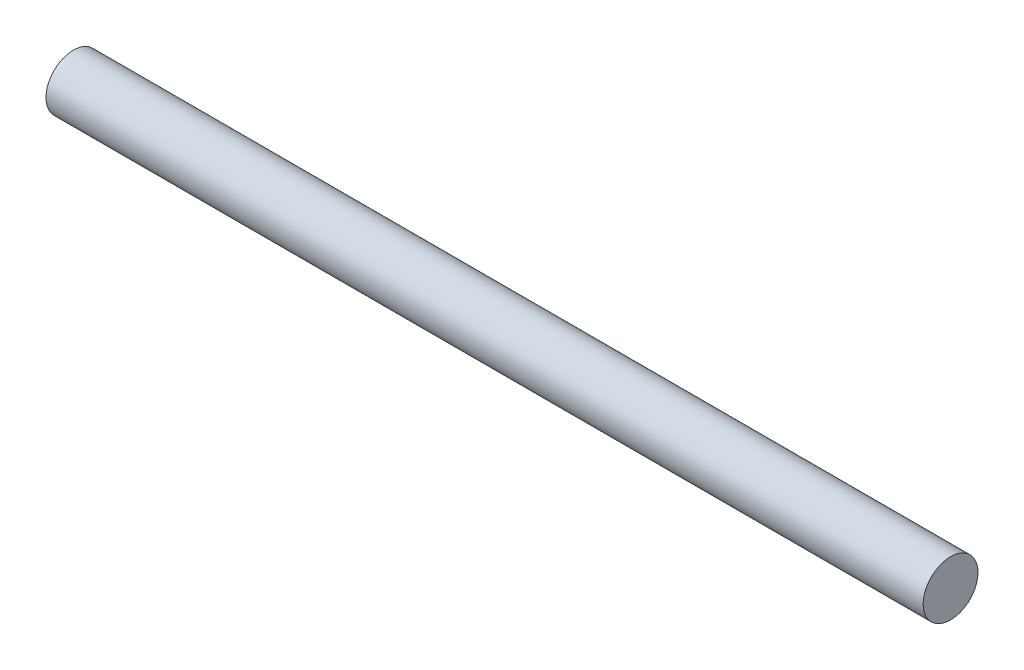
ISO-10303-21;
HEADER;
FILE_DESCRIPTION(('STEP AP214'),'2;1');
FILE_NAME('part.step','',(''),(''),'','','');
FILE_SCHEMA(('AUTOMOTIVE_DESIGN { 1 0 10303 214 1 1 1 1 }'));
ENDSEC;
DATA;
#1=APPLICATION_CONTEXT('core data for automotive mechanical design processes');
#2=APPLICATION_PROTOCOL_DEFINITION('international standard','automotive_design',2000,#1);
#3=PRODUCT_CONTEXT('',#1,'mechanical');
#4=PRODUCT('Part','Part','',(#3));
#5=PRODUCT_RELATED_PRODUCT_CATEGORY('part','',(#4));
#6=PRODUCT_DEFINITION_FORMATION('','',#4);
#7=PRODUCT_DEFINITION_CONTEXT('part definition',#1,'design');
#8=PRODUCT_DEFINITION('design','',#6,#7);
#9=PRODUCT_DEFINITION_SHAPE('','',#8);
#10=(LENGTH_UNIT() NAMED_UNIT(*) SI_UNIT(.MILLI.,.METRE.));
#11=(NAMED_UNIT(*) PLANE_ANGLE_UNIT() SI_UNIT($,.RADIAN.));
#12=(NAMED_UNIT(*) SI_UNIT($,.STERADIAN.) SOLID_ANGLE_UNIT());
#13=UNCERTAINTY_MEASURE_WITH_UNIT(LENGTH_MEASURE(1.E-05),#10,'distance_accuracy_value','');
#14=(GEOMETRIC_REPRESENTATION_CONTEXT(3) GLOBAL_UNCERTAINTY_ASSIGNED_CONTEXT((#13)) GLOBAL_UNIT_ASSIGNED_CONTEXT((#10,
#11,#12)) REPRESENTATION_CONTEXT('',''));
#15=CARTESIAN_POINT('',(0.,0.,0.));
#16=DIRECTION('',(0.,0.,1.));
#17=DIRECTION('',(1.,0.,0.));
#18=AXIS2_PLACEMENT_3D('',#15,#16,#17);
#19=CARTESIAN_POINT('',(76.2,0.,0.));
#20=DIRECTION('',(-1.,0.,0.));
#21=DIRECTION('',(0.,0.,1.));
#22=AXIS2_PLACEMENT_3D('',#19,#20,#21);
#23=CYLINDRICAL_SURFACE('',#22,2.38125);
#24=CARTESIAN_POINT('',(76.2,0.,0.));
#25=DIRECTION('',(1.,0.,0.));
#26=DIRECTION('',(0.,0.,-1.));
#27=AXIS2_PLACEMENT_3D('',#24,#25,#26);
#28=CIRCLE('',#27,2.38125);
#29=CARTESIAN_POINT('',(76.2,0.,-2.38125));
#30=VERTEX_POINT('',#29);
#31=EDGE_CURVE('E10',#30,#30,#28,.T.);
#32=ORIENTED_EDGE('',*,*,#31,.F.);
#33=EDGE_LOOP('',(#32));
#34=FACE_BOUND('',#33,.T.);
#35=CARTESIAN_POINT('',(0.,0.,0.));
#36=DIRECTION('',(1.,0.,0.));
#37=DIRECTION('',(0.,0.,-1.));
#38=AXIS2_PLACEMENT_3D('',#35,#36,#37);
#39=CIRCLE('',#38,2.38125);
#40=CARTESIAN_POINT('',(0.,0.,-2.38125));
#41=VERTEX_POINT('',#40);
#42=EDGE_CURVE('E44',#41,#41,#39,.T.);
#43=ORIENTED_EDGE('',*,*,#42,.T.);
#44=EDGE_LOOP('',(#43));
#45=FACE_BOUND('',#44,.T.);
#46=ADVANCED_FACE('F41',(#34,#45),#23,.T.);
#47=CARTESIAN_POINT('',(76.2,0.,0.));
#48=DIRECTION('',(1.,0.,0.));
#49=DIRECTION('',(0.,0.,-1.));
#50=AXIS2_PLACEMENT_3D('',#47,#48,#49);
#51=PLANE('',#50);
#52=ORIENTED_EDGE('',*,*,#31,.T.);
#53=EDGE_LOOP('',(#52));
#54=FACE_BOUND('',#53,.T.);
#55=ADVANCED_FACE('F58',(#54),#51,.T.);
#56=CARTESIAN_POINT('',(0.,0.,0.));
#57=DIRECTION('',(1.,0.,0.));
#58=DIRECTION('',(0.,0.,-1.));
#59=AXIS2_PLACEMENT_3D('',#56,#57,#58);
#60=PLANE('',#59);
#61=ORIENTED_EDGE('',*,*,#42,.F.);
#62=EDGE_LOOP('',(#61));
#63=FACE_BOUND('',#62,.T.);
#64=ADVANCED_FACE('F56',(#63),#60,.F.);
#65=CLOSED_SHELL('',(#46,#55,#64));
#66=MANIFOLD_SOLID_BREP('B2',#65);
#67=ADVANCED_BREP_SHAPE_REPRESENTATION('',(#18,#66),#14);
#68=SHAPE_DEFINITION_REPRESENTATION(#9,#67);
ENDSEC;
END-ISO-10303-21;
